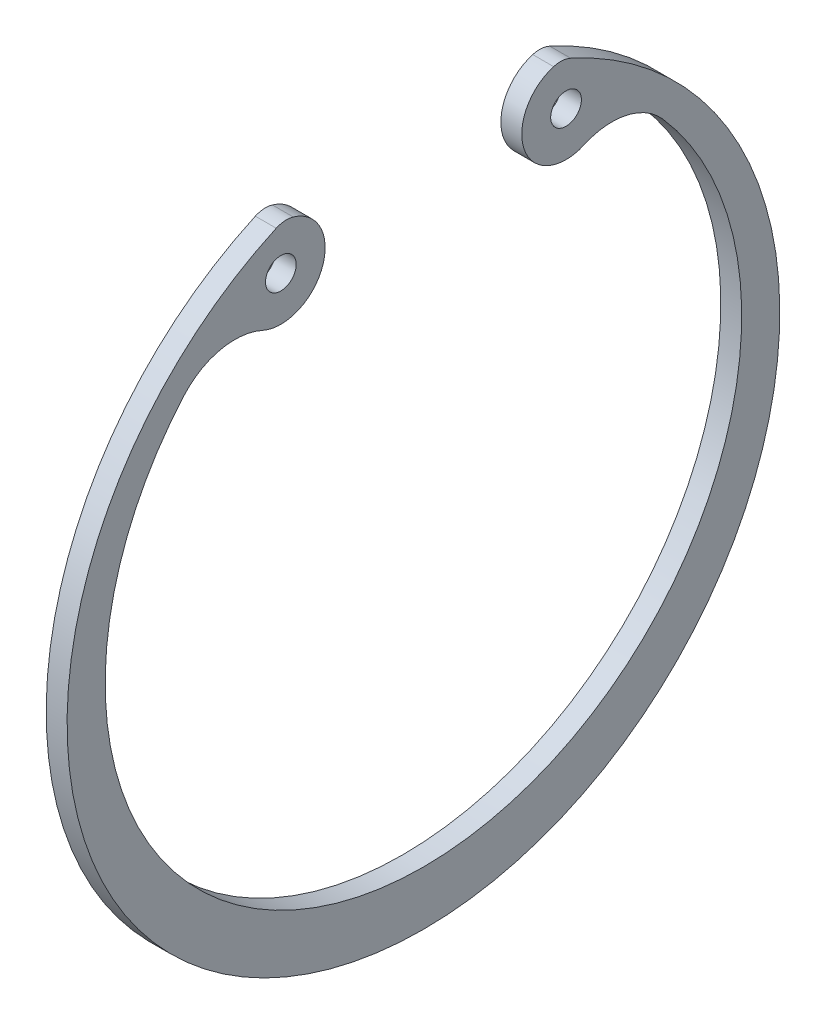
ISO-10303-21;
HEADER;
FILE_DESCRIPTION(('STEP AP214'),'2;1');
FILE_NAME('part.step','',(''),(''),'','','');
FILE_SCHEMA(('AUTOMOTIVE_DESIGN { 1 0 10303 214 1 1 1 1 }'));
ENDSEC;
DATA;
#1=APPLICATION_CONTEXT('core data for automotive mechanical design processes');
#2=APPLICATION_PROTOCOL_DEFINITION('international standard','automotive_design',2000,#1);
#3=PRODUCT_CONTEXT('',#1,'mechanical');
#4=PRODUCT('Part','Part','',(#3));
#5=PRODUCT_RELATED_PRODUCT_CATEGORY('part','',(#4));
#6=PRODUCT_DEFINITION_FORMATION('','',#4);
#7=PRODUCT_DEFINITION_CONTEXT('part definition',#1,'design');
#8=PRODUCT_DEFINITION('design','',#6,#7);
#9=PRODUCT_DEFINITION_SHAPE('','',#8);
#10=(LENGTH_UNIT() NAMED_UNIT(*) SI_UNIT(.MILLI.,.METRE.));
#11=(NAMED_UNIT(*) PLANE_ANGLE_UNIT() SI_UNIT($,.RADIAN.));
#12=(NAMED_UNIT(*) SI_UNIT($,.STERADIAN.) SOLID_ANGLE_UNIT());
#13=UNCERTAINTY_MEASURE_WITH_UNIT(LENGTH_MEASURE(1.E-05),#10,'distance_accuracy_value','');
#14=(GEOMETRIC_REPRESENTATION_CONTEXT(3) GLOBAL_UNCERTAINTY_ASSIGNED_CONTEXT((#13)) GLOBAL_UNIT_ASSIGNED_CONTEXT((#10,
#11,#12)) REPRESENTATION_CONTEXT('',''));
#15=CARTESIAN_POINT('',(0.,0.,0.));
#16=DIRECTION('',(0.,0.,1.));
#17=DIRECTION('',(1.,0.,0.));
#18=AXIS2_PLACEMENT_3D('',#15,#16,#17);
#19=CARTESIAN_POINT('',(1.7,12.2939193308794,5.5775933417407));
#20=DIRECTION('',(1.,0.,0.));
#21=DIRECTION('',(0.,0.,-1.));
#22=AXIS2_PLACEMENT_3D('',#19,#20,#21);
#23=PLANE('',#22);
#24=CARTESIAN_POINT('',(1.7,23.0477601133339,-11.6041988113305));
#25=DIRECTION('',(1.,0.,0.));
#26=DIRECTION('',(0.,0.,-1.));
#27=AXIS2_PLACEMENT_3D('',#24,#25,#26);
#28=CIRCLE('',#27,1.25);
#29=CARTESIAN_POINT('',(1.7,23.0477601133339,-12.8541988113305));
#30=VERTEX_POINT('',#29);
#31=EDGE_CURVE('E136',#30,#30,#28,.T.);
#32=ORIENTED_EDGE('',*,*,#31,.F.);
#33=EDGE_LOOP('',(#32));
#34=FACE_BOUND('',#33,.T.);
#35=CARTESIAN_POINT('',(1.7,24.5878386617588,11.1551866834814));
#36=DIRECTION('',(1.,0.,0.));
#37=DIRECTION('',(0.,0.,-1.));
#38=AXIS2_PLACEMENT_3D('',#35,#36,#37);
#39=CIRCLE('',#38,2.);
#40=CARTESIAN_POINT('',(1.7,26.5078981176658,10.5953905725783));
#41=VERTEX_POINT('',#40);
#42=CARTESIAN_POINT('',(1.7,26.4091600441113,11.9814968081837));
#43=VERTEX_POINT('',#42);
#44=EDGE_CURVE('E147',#41,#43,#39,.T.);
#45=ORIENTED_EDGE('',*,*,#44,.T.);
#46=CARTESIAN_POINT('',(1.7,0.,0.));
#47=DIRECTION('',(1.,0.,0.));
#48=DIRECTION('',(0.,0.,-1.));
#49=AXIS2_PLACEMENT_3D('',#46,#47,#48);
#50=CIRCLE('',#49,29.);
#51=CARTESIAN_POINT('',(1.7,26.4091600441113,-11.9814968081837));
#52=VERTEX_POINT('',#51);
#53=EDGE_CURVE('E95',#43,#52,#50,.T.);
#54=ORIENTED_EDGE('',*,*,#53,.T.);
#55=CARTESIAN_POINT('',(1.7,24.5878386617588,-11.1551866834814));
#56=DIRECTION('',(1.,0.,0.));
#57=DIRECTION('',(0.,0.,1.));
#58=AXIS2_PLACEMENT_3D('',#55,#56,#57);
#59=CIRCLE('',#58,2.);
#60=CARTESIAN_POINT('',(1.7,26.5078981176658,-10.5953905725783));
#61=VERTEX_POINT('',#60);
#62=EDGE_CURVE('E162',#52,#61,#59,.T.);
#63=ORIENTED_EDGE('',*,*,#62,.T.);
#64=CARTESIAN_POINT('',(1.7,23.0477601133339,-11.6041988113305));
#65=DIRECTION('',(1.,0.,0.));
#66=DIRECTION('',(0.,0.,-1.));
#67=AXIS2_PLACEMENT_3D('',#64,#65,#66);
#68=CIRCLE('',#67,3.60419881133045);
#69=CARTESIAN_POINT('',(1.7,19.7612511794198,-13.0837622938814));
#70=VERTEX_POINT('',#69);
#71=EDGE_CURVE('E175',#61,#70,#68,.T.);
#72=ORIENTED_EDGE('',*,*,#71,.T.);
#73=CARTESIAN_POINT('',(1.7,14.7460452813147,-15.3415731361825));
#74=DIRECTION('',(-1.,0.,0.));
#75=DIRECTION('',(0.,0.,-1.));
#76=AXIS2_PLACEMENT_3D('',#73,#74,#75);
#77=CIRCLE('',#76,5.5);
#78=CARTESIAN_POINT('',(1.7,18.3712045483358,-19.4777815797611));
#79=VERTEX_POINT('',#78);
#80=EDGE_CURVE('E114',#70,#79,#77,.T.);
#81=ORIENTED_EDGE('',*,*,#80,.T.);
#82=CARTESIAN_POINT('',(1.7,1.3,0.));
#83=DIRECTION('',(-1.,0.,0.));
#84=DIRECTION('',(0.,0.,-1.));
#85=AXIS2_PLACEMENT_3D('',#82,#83,#84);
#86=CIRCLE('',#85,25.9);
#87=CARTESIAN_POINT('',(1.7,18.3712045483358,19.4777815797611));
#88=VERTEX_POINT('',#87);
#89=EDGE_CURVE('E108',#79,#88,#86,.T.);
#90=ORIENTED_EDGE('',*,*,#89,.T.);
#91=CARTESIAN_POINT('',(1.7,14.7460452813147,15.3415731361825));
#92=DIRECTION('',(-1.,0.,0.));
#93=DIRECTION('',(0.,0.,1.));
#94=AXIS2_PLACEMENT_3D('',#91,#92,#93);
#95=CIRCLE('',#94,5.5);
#96=CARTESIAN_POINT('',(1.7,19.7612511794198,13.0837622938814));
#97=VERTEX_POINT('',#96);
#98=EDGE_CURVE('E112',#88,#97,#95,.T.);
#99=ORIENTED_EDGE('',*,*,#98,.T.);
#100=CARTESIAN_POINT('',(1.7,23.0477601133339,11.6041988113305));
#101=DIRECTION('',(1.,0.,0.));
#102=DIRECTION('',(0.,0.,1.));
#103=AXIS2_PLACEMENT_3D('',#100,#101,#102);
#104=CIRCLE('',#103,3.60419881133045);
#105=EDGE_CURVE('E52',#97,#41,#104,.T.);
#106=ORIENTED_EDGE('',*,*,#105,.T.);
#107=EDGE_LOOP('',(#45,#54,#63,#72,#81,#90,#99,#106));
#108=FACE_BOUND('',#107,.T.);
#109=CARTESIAN_POINT('',(1.7,23.0477601133339,11.6041988113305));
#110=DIRECTION('',(1.,0.,0.));
#111=DIRECTION('',(0.,0.,1.));
#112=AXIS2_PLACEMENT_3D('',#109,#110,#111);
#113=CIRCLE('',#112,1.25);
#114=CARTESIAN_POINT('',(1.7,23.0477601133339,12.8541988113305));
#115=VERTEX_POINT('',#114);
#116=EDGE_CURVE('E184',#115,#115,#113,.T.);
#117=ORIENTED_EDGE('',*,*,#116,.F.);
#118=EDGE_LOOP('',(#117));
#119=FACE_BOUND('',#118,.T.);
#120=ADVANCED_FACE('F35',(#34,#108,#119),#23,.T.);
#121=CARTESIAN_POINT('',(0.,12.2939193308794,5.5775933417407));
#122=DIRECTION('',(1.,0.,0.));
#123=DIRECTION('',(0.,0.,-1.));
#124=AXIS2_PLACEMENT_3D('',#121,#122,#123);
#125=PLANE('',#124);
#126=CARTESIAN_POINT('',(0.,24.5878386617588,11.1551866834814));
#127=DIRECTION('',(1.,0.,0.));
#128=DIRECTION('',(0.,0.,-1.));
#129=AXIS2_PLACEMENT_3D('',#126,#127,#128);
#130=CIRCLE('',#129,2.);
#131=CARTESIAN_POINT('',(0.,26.5078981176658,10.5953905725783));
#132=VERTEX_POINT('',#131);
#133=CARTESIAN_POINT('',(0.,26.4091600441113,11.9814968081837));
#134=VERTEX_POINT('',#133);
#135=EDGE_CURVE('E132',#132,#134,#130,.T.);
#136=ORIENTED_EDGE('',*,*,#135,.F.);
#137=CARTESIAN_POINT('',(0.,23.0477601133339,11.6041988113305));
#138=DIRECTION('',(1.,0.,0.));
#139=DIRECTION('',(0.,0.,1.));
#140=AXIS2_PLACEMENT_3D('',#137,#138,#139);
#141=CIRCLE('',#140,3.60419881133045);
#142=CARTESIAN_POINT('',(0.,19.7612511794198,13.0837622938814));
#143=VERTEX_POINT('',#142);
#144=EDGE_CURVE('E87',#143,#132,#141,.T.);
#145=ORIENTED_EDGE('',*,*,#144,.F.);
#146=CARTESIAN_POINT('',(0.,14.7460452813147,15.3415731361825));
#147=DIRECTION('',(-1.,0.,0.));
#148=DIRECTION('',(0.,0.,1.));
#149=AXIS2_PLACEMENT_3D('',#146,#147,#148);
#150=CIRCLE('',#149,5.5);
#151=CARTESIAN_POINT('',(0.,18.3712045483358,19.4777815797611));
#152=VERTEX_POINT('',#151);
#153=EDGE_CURVE('E81',#152,#143,#150,.T.);
#154=ORIENTED_EDGE('',*,*,#153,.F.);
#155=CARTESIAN_POINT('',(0.,1.3,0.));
#156=DIRECTION('',(-1.,0.,0.));
#157=DIRECTION('',(0.,0.,-1.));
#158=AXIS2_PLACEMENT_3D('',#155,#156,#157);
#159=CIRCLE('',#158,25.9);
#160=CARTESIAN_POINT('',(0.,18.3712045483358,-19.4777815797611));
#161=VERTEX_POINT('',#160);
#162=EDGE_CURVE('E122',#161,#152,#159,.T.);
#163=ORIENTED_EDGE('',*,*,#162,.F.);
#164=CARTESIAN_POINT('',(0.,14.7460452813147,-15.3415731361825));
#165=DIRECTION('',(-1.,0.,0.));
#166=DIRECTION('',(0.,0.,-1.));
#167=AXIS2_PLACEMENT_3D('',#164,#165,#166);
#168=CIRCLE('',#167,5.5);
#169=CARTESIAN_POINT('',(0.,19.7612511794198,-13.0837622938814));
#170=VERTEX_POINT('',#169);
#171=EDGE_CURVE('E142',#170,#161,#168,.T.);
#172=ORIENTED_EDGE('',*,*,#171,.F.);
#173=CARTESIAN_POINT('',(0.,23.0477601133339,-11.6041988113305));
#174=DIRECTION('',(1.,0.,0.));
#175=DIRECTION('',(0.,0.,-1.));
#176=AXIS2_PLACEMENT_3D('',#173,#174,#175);
#177=CIRCLE('',#176,3.60419881133045);
#178=CARTESIAN_POINT('',(0.,26.5078981176658,-10.5953905725783));
#179=VERTEX_POINT('',#178);
#180=EDGE_CURVE('E140',#179,#170,#177,.T.);
#181=ORIENTED_EDGE('',*,*,#180,.F.);
#182=CARTESIAN_POINT('',(0.,24.5878386617588,-11.1551866834814));
#183=DIRECTION('',(1.,0.,0.));
#184=DIRECTION('',(0.,0.,1.));
#185=AXIS2_PLACEMENT_3D('',#182,#183,#184);
#186=CIRCLE('',#185,2.);
#187=CARTESIAN_POINT('',(0.,26.4091600441113,-11.9814968081837));
#188=VERTEX_POINT('',#187);
#189=EDGE_CURVE('E138',#188,#179,#186,.T.);
#190=ORIENTED_EDGE('',*,*,#189,.F.);
#191=CARTESIAN_POINT('',(0.,0.,0.));
#192=DIRECTION('',(1.,0.,0.));
#193=DIRECTION('',(0.,0.,-1.));
#194=AXIS2_PLACEMENT_3D('',#191,#192,#193);
#195=CIRCLE('',#194,29.);
#196=EDGE_CURVE('E135',#134,#188,#195,.T.);
#197=ORIENTED_EDGE('',*,*,#196,.F.);
#198=EDGE_LOOP('',(#136,#145,#154,#163,#172,#181,#190,#197));
#199=FACE_BOUND('',#198,.T.);
#200=CARTESIAN_POINT('',(0.,23.0477601133339,-11.6041988113305));
#201=DIRECTION('',(1.,0.,0.));
#202=DIRECTION('',(0.,0.,-1.));
#203=AXIS2_PLACEMENT_3D('',#200,#201,#202);
#204=CIRCLE('',#203,1.25);
#205=CARTESIAN_POINT('',(0.,23.0477601133339,-12.8541988113305));
#206=VERTEX_POINT('',#205);
#207=EDGE_CURVE('E181',#206,#206,#204,.T.);
#208=ORIENTED_EDGE('',*,*,#207,.T.);
#209=EDGE_LOOP('',(#208));
#210=FACE_BOUND('',#209,.T.);
#211=CARTESIAN_POINT('',(0.,23.0477601133339,11.6041988113305));
#212=DIRECTION('',(1.,0.,0.));
#213=DIRECTION('',(0.,0.,1.));
#214=AXIS2_PLACEMENT_3D('',#211,#212,#213);
#215=CIRCLE('',#214,1.25);
#216=CARTESIAN_POINT('',(0.,23.0477601133339,12.8541988113305));
#217=VERTEX_POINT('',#216);
#218=EDGE_CURVE('E187',#217,#217,#215,.T.);
#219=ORIENTED_EDGE('',*,*,#218,.T.);
#220=EDGE_LOOP('',(#219));
#221=FACE_BOUND('',#220,.T.);
#222=ADVANCED_FACE('F166',(#199,#210,#221),#125,.F.);
#223=CARTESIAN_POINT('',(1.7,24.5878386617588,11.1551866834814));
#224=DIRECTION('',(-1.,0.,0.));
#225=DIRECTION('',(0.,0.,1.));
#226=AXIS2_PLACEMENT_3D('',#223,#224,#225);
#227=CYLINDRICAL_SURFACE('',#226,2.);
#228=ORIENTED_EDGE('',*,*,#135,.T.);
#229=DIRECTION('',(-1.,0.,0.));
#230=VECTOR('',#229,1.);
#231=CARTESIAN_POINT('',(1.7,26.4091600441113,11.9814968081837));
#232=LINE('',#231,#230);
#233=EDGE_CURVE('E11',#43,#134,#232,.T.);
#234=ORIENTED_EDGE('',*,*,#233,.F.);
#235=ORIENTED_EDGE('',*,*,#44,.F.);
#236=DIRECTION('',(-1.,0.,0.));
#237=VECTOR('',#236,1.);
#238=CARTESIAN_POINT('',(1.7,26.5078981176658,10.5953905725783));
#239=LINE('',#238,#237);
#240=EDGE_CURVE('E128',#41,#132,#239,.T.);
#241=ORIENTED_EDGE('',*,*,#240,.T.);
#242=EDGE_LOOP('',(#228,#234,#235,#241));
#243=FACE_BOUND('',#242,.T.);
#244=ADVANCED_FACE('F37',(#243),#227,.T.);
#245=CARTESIAN_POINT('',(1.7,0.,0.));
#246=DIRECTION('',(-1.,0.,0.));
#247=DIRECTION('',(0.,0.,1.));
#248=AXIS2_PLACEMENT_3D('',#245,#246,#247);
#249=CYLINDRICAL_SURFACE('',#248,29.);
#250=ORIENTED_EDGE('',*,*,#196,.T.);
#251=DIRECTION('',(-1.,0.,0.));
#252=VECTOR('',#251,1.);
#253=CARTESIAN_POINT('',(1.7,26.4091600441113,-11.9814968081837));
#254=LINE('',#253,#252);
#255=EDGE_CURVE('E44',#52,#188,#254,.T.);
#256=ORIENTED_EDGE('',*,*,#255,.F.);
#257=ORIENTED_EDGE('',*,*,#53,.F.);
#258=ORIENTED_EDGE('',*,*,#233,.T.);
#259=EDGE_LOOP('',(#250,#256,#257,#258));
#260=FACE_BOUND('',#259,.T.);
#261=ADVANCED_FACE('F219',(#260),#249,.T.);
#262=CARTESIAN_POINT('',(1.7,24.5878386617588,-11.1551866834814));
#263=DIRECTION('',(-1.,0.,0.));
#264=DIRECTION('',(0.,0.,1.));
#265=AXIS2_PLACEMENT_3D('',#262,#263,#264);
#266=CYLINDRICAL_SURFACE('',#265,2.);
#267=ORIENTED_EDGE('',*,*,#189,.T.);
#268=DIRECTION('',(-1.,0.,0.));
#269=VECTOR('',#268,1.);
#270=CARTESIAN_POINT('',(1.7,26.5078981176658,-10.5953905725783));
#271=LINE('',#270,#269);
#272=EDGE_CURVE('E154',#61,#179,#271,.T.);
#273=ORIENTED_EDGE('',*,*,#272,.F.);
#274=ORIENTED_EDGE('',*,*,#62,.F.);
#275=ORIENTED_EDGE('',*,*,#255,.T.);
#276=EDGE_LOOP('',(#267,#273,#274,#275));
#277=FACE_BOUND('',#276,.T.);
#278=ADVANCED_FACE('F160',(#277),#266,.T.);
#279=CARTESIAN_POINT('',(1.7,23.0477601133339,-11.6041988113305));
#280=DIRECTION('',(-1.,0.,0.));
#281=DIRECTION('',(0.,0.,1.));
#282=AXIS2_PLACEMENT_3D('',#279,#280,#281);
#283=CYLINDRICAL_SURFACE('',#282,3.60419881133045);
#284=ORIENTED_EDGE('',*,*,#180,.T.);
#285=DIRECTION('',(-1.,0.,0.));
#286=VECTOR('',#285,1.);
#287=CARTESIAN_POINT('',(1.7,19.7612511794198,-13.0837622938814));
#288=LINE('',#287,#286);
#289=EDGE_CURVE('E151',#70,#170,#288,.T.);
#290=ORIENTED_EDGE('',*,*,#289,.F.);
#291=ORIENTED_EDGE('',*,*,#71,.F.);
#292=ORIENTED_EDGE('',*,*,#272,.T.);
#293=EDGE_LOOP('',(#284,#290,#291,#292));
#294=FACE_BOUND('',#293,.T.);
#295=ADVANCED_FACE('F171',(#294),#283,.T.);
#296=CARTESIAN_POINT('',(1.7,14.7460452813147,-15.3415731361825));
#297=DIRECTION('',(-1.,0.,0.));
#298=DIRECTION('',(0.,0.,1.));
#299=AXIS2_PLACEMENT_3D('',#296,#297,#298);
#300=CYLINDRICAL_SURFACE('',#299,5.5);
#301=ORIENTED_EDGE('',*,*,#171,.T.);
#302=DIRECTION('',(-1.,0.,0.));
#303=VECTOR('',#302,1.);
#304=CARTESIAN_POINT('',(1.7,18.3712045483358,-19.4777815797611));
#305=LINE('',#304,#303);
#306=EDGE_CURVE('E123',#79,#161,#305,.T.);
#307=ORIENTED_EDGE('',*,*,#306,.F.);
#308=ORIENTED_EDGE('',*,*,#80,.F.);
#309=ORIENTED_EDGE('',*,*,#289,.T.);
#310=EDGE_LOOP('',(#301,#307,#308,#309));
#311=FACE_BOUND('',#310,.T.);
#312=ADVANCED_FACE('F174',(#311),#300,.F.);
#313=CARTESIAN_POINT('',(1.7,1.3,0.));
#314=DIRECTION('',(-1.,0.,0.));
#315=DIRECTION('',(0.,0.,1.));
#316=AXIS2_PLACEMENT_3D('',#313,#314,#315);
#317=CYLINDRICAL_SURFACE('',#316,25.9);
#318=ORIENTED_EDGE('',*,*,#162,.T.);
#319=DIRECTION('',(-1.,0.,0.));
#320=VECTOR('',#319,1.);
#321=CARTESIAN_POINT('',(1.7,18.3712045483358,19.4777815797611));
#322=LINE('',#321,#320);
#323=EDGE_CURVE('E119',#88,#152,#322,.T.);
#324=ORIENTED_EDGE('',*,*,#323,.F.);
#325=ORIENTED_EDGE('',*,*,#89,.F.);
#326=ORIENTED_EDGE('',*,*,#306,.T.);
#327=EDGE_LOOP('',(#318,#324,#325,#326));
#328=FACE_BOUND('',#327,.T.);
#329=ADVANCED_FACE('F120',(#328),#317,.F.);
#330=CARTESIAN_POINT('',(1.7,14.7460452813147,15.3415731361825));
#331=DIRECTION('',(-1.,0.,0.));
#332=DIRECTION('',(0.,0.,1.));
#333=AXIS2_PLACEMENT_3D('',#330,#331,#332);
#334=CYLINDRICAL_SURFACE('',#333,5.5);
#335=ORIENTED_EDGE('',*,*,#153,.T.);
#336=DIRECTION('',(-1.,0.,0.));
#337=VECTOR('',#336,1.);
#338=CARTESIAN_POINT('',(1.7,19.7612511794198,13.0837622938814));
#339=LINE('',#338,#337);
#340=EDGE_CURVE('E124',#97,#143,#339,.T.);
#341=ORIENTED_EDGE('',*,*,#340,.F.);
#342=ORIENTED_EDGE('',*,*,#98,.F.);
#343=ORIENTED_EDGE('',*,*,#323,.T.);
#344=EDGE_LOOP('',(#335,#341,#342,#343));
#345=FACE_BOUND('',#344,.T.);
#346=ADVANCED_FACE('F126',(#345),#334,.F.);
#347=CARTESIAN_POINT('',(1.7,23.0477601133339,11.6041988113305));
#348=DIRECTION('',(-1.,0.,0.));
#349=DIRECTION('',(0.,0.,1.));
#350=AXIS2_PLACEMENT_3D('',#347,#348,#349);
#351=CYLINDRICAL_SURFACE('',#350,3.60419881133045);
#352=ORIENTED_EDGE('',*,*,#144,.T.);
#353=ORIENTED_EDGE('',*,*,#240,.F.);
#354=ORIENTED_EDGE('',*,*,#105,.F.);
#355=ORIENTED_EDGE('',*,*,#340,.T.);
#356=EDGE_LOOP('',(#352,#353,#354,#355));
#357=FACE_BOUND('',#356,.T.);
#358=ADVANCED_FACE('F207',(#357),#351,.T.);
#359=CARTESIAN_POINT('',(1.7,23.0477601133339,-11.6041988113305));
#360=DIRECTION('',(-1.,0.,0.));
#361=DIRECTION('',(0.,0.,1.));
#362=AXIS2_PLACEMENT_3D('',#359,#360,#361);
#363=CYLINDRICAL_SURFACE('',#362,1.25);
#364=ORIENTED_EDGE('',*,*,#31,.T.);
#365=EDGE_LOOP('',(#364));
#366=FACE_BOUND('',#365,.T.);
#367=ORIENTED_EDGE('',*,*,#207,.F.);
#368=EDGE_LOOP('',(#367));
#369=FACE_BOUND('',#368,.T.);
#370=ADVANCED_FACE('F204',(#366,#369),#363,.F.);
#371=CARTESIAN_POINT('',(1.7,23.0477601133339,11.6041988113305));
#372=DIRECTION('',(-1.,0.,0.));
#373=DIRECTION('',(0.,0.,1.));
#374=AXIS2_PLACEMENT_3D('',#371,#372,#373);
#375=CYLINDRICAL_SURFACE('',#374,1.25);
#376=ORIENTED_EDGE('',*,*,#116,.T.);
#377=EDGE_LOOP('',(#376));
#378=FACE_BOUND('',#377,.T.);
#379=ORIENTED_EDGE('',*,*,#218,.F.);
#380=EDGE_LOOP('',(#379));
#381=FACE_BOUND('',#380,.T.);
#382=ADVANCED_FACE('F193',(#378,#381),#375,.F.);
#383=CLOSED_SHELL('',(#120,#222,#244,#261,#278,#295,#312,#329,#346,#358,#370,#382));
#384=MANIFOLD_SOLID_BREP('B2',#383);
#385=ADVANCED_BREP_SHAPE_REPRESENTATION('',(#18,#384),#14);
#386=SHAPE_DEFINITION_REPRESENTATION(#9,#385);
ENDSEC;
END-ISO-10303-21;
